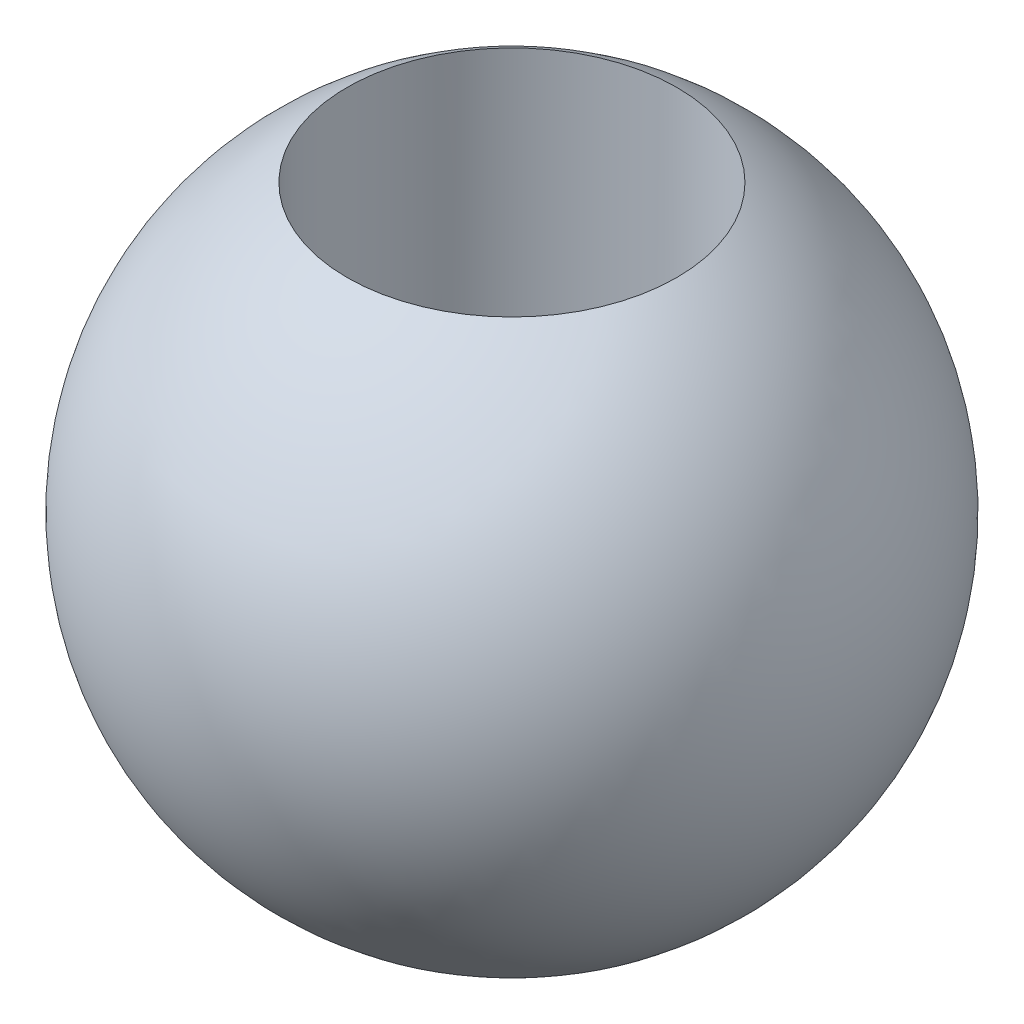
ISO-10303-21;
HEADER;
FILE_DESCRIPTION(('STEP AP214'),'2;1');
FILE_NAME('part.step','',(''),(''),'','','');
FILE_SCHEMA(('AUTOMOTIVE_DESIGN { 1 0 10303 214 1 1 1 1 }'));
ENDSEC;
DATA;
#1=APPLICATION_CONTEXT('core data for automotive mechanical design processes');
#2=APPLICATION_PROTOCOL_DEFINITION('international standard','automotive_design',2000,#1);
#3=PRODUCT_CONTEXT('',#1,'mechanical');
#4=PRODUCT('Part','Part','',(#3));
#5=PRODUCT_RELATED_PRODUCT_CATEGORY('part','',(#4));
#6=PRODUCT_DEFINITION_FORMATION('','',#4);
#7=PRODUCT_DEFINITION_CONTEXT('part definition',#1,'design');
#8=PRODUCT_DEFINITION('design','',#6,#7);
#9=PRODUCT_DEFINITION_SHAPE('','',#8);
#10=(LENGTH_UNIT() NAMED_UNIT(*) SI_UNIT(.MILLI.,.METRE.));
#11=(NAMED_UNIT(*) PLANE_ANGLE_UNIT() SI_UNIT($,.RADIAN.));
#12=(NAMED_UNIT(*) SI_UNIT($,.STERADIAN.) SOLID_ANGLE_UNIT());
#13=UNCERTAINTY_MEASURE_WITH_UNIT(LENGTH_MEASURE(1.E-05),#10,'distance_accuracy_value','');
#14=(GEOMETRIC_REPRESENTATION_CONTEXT(3) GLOBAL_UNCERTAINTY_ASSIGNED_CONTEXT((#13)) GLOBAL_UNIT_ASSIGNED_CONTEXT((#10,
#11,#12)) REPRESENTATION_CONTEXT('',''));
#15=CARTESIAN_POINT('',(0.,0.,0.));
#16=DIRECTION('',(0.,0.,1.));
#17=DIRECTION('',(1.,0.,0.));
#18=AXIS2_PLACEMENT_3D('',#15,#16,#17);
#19=CARTESIAN_POINT('',(0.,0.,0.));
#20=DIRECTION('',(0.,1.,0.));
#21=DIRECTION('',(1.,0.,0.));
#22=AXIS2_PLACEMENT_3D('',#19,#20,#21);
#23=SPHERICAL_SURFACE('',#22,10.);
#24=CARTESIAN_POINT('',(0.,8.66025403784439,0.));
#25=DIRECTION('',(0.,-1.,0.));
#26=DIRECTION('',(0.,0.,-1.));
#27=AXIS2_PLACEMENT_3D('',#24,#25,#26);
#28=CIRCLE('',#27,5.);
#29=CARTESIAN_POINT('',(0.,8.66025403784439,-5.));
#30=VERTEX_POINT('',#29);
#31=EDGE_CURVE('E10',#30,#30,#28,.T.);
#32=ORIENTED_EDGE('',*,*,#31,.T.);
#33=EDGE_LOOP('',(#32));
#34=FACE_BOUND('',#33,.T.);
#35=ADVANCED_FACE('F32',(#34),#23,.T.);
#36=CARTESIAN_POINT('',(0.,-2.5,0.));
#37=DIRECTION('',(0.,1.,0.));
#38=DIRECTION('',(0.,0.,1.));
#39=AXIS2_PLACEMENT_3D('',#36,#37,#38);
#40=CYLINDRICAL_SURFACE('',#39,5.);
#41=CARTESIAN_POINT('',(0.,-2.5,0.));
#42=DIRECTION('',(0.,1.,0.));
#43=DIRECTION('',(0.,0.,1.));
#44=AXIS2_PLACEMENT_3D('',#41,#42,#43);
#45=CIRCLE('',#44,5.);
#46=CARTESIAN_POINT('',(0.,-2.5,5.));
#47=VERTEX_POINT('',#46);
#48=EDGE_CURVE('E38',#47,#47,#45,.T.);
#49=ORIENTED_EDGE('',*,*,#48,.F.);
#50=EDGE_LOOP('',(#49));
#51=FACE_BOUND('',#50,.T.);
#52=ORIENTED_EDGE('',*,*,#31,.F.);
#53=EDGE_LOOP('',(#52));
#54=FACE_BOUND('',#53,.T.);
#55=ADVANCED_FACE('F46',(#51,#54),#40,.F.);
#56=CARTESIAN_POINT('',(0.,-2.5,0.));
#57=DIRECTION('',(0.,1.,0.));
#58=DIRECTION('',(0.,0.,1.));
#59=AXIS2_PLACEMENT_3D('',#56,#57,#58);
#60=PLANE('',#59);
#61=ORIENTED_EDGE('',*,*,#48,.T.);
#62=EDGE_LOOP('',(#61));
#63=FACE_BOUND('',#62,.T.);
#64=ADVANCED_FACE('F44',(#63),#60,.T.);
#65=CLOSED_SHELL('',(#35,#55,#64));
#66=MANIFOLD_SOLID_BREP('B2',#65);
#67=ADVANCED_BREP_SHAPE_REPRESENTATION('',(#18,#66),#14);
#68=SHAPE_DEFINITION_REPRESENTATION(#9,#67);
ENDSEC;
END-ISO-10303-21;
